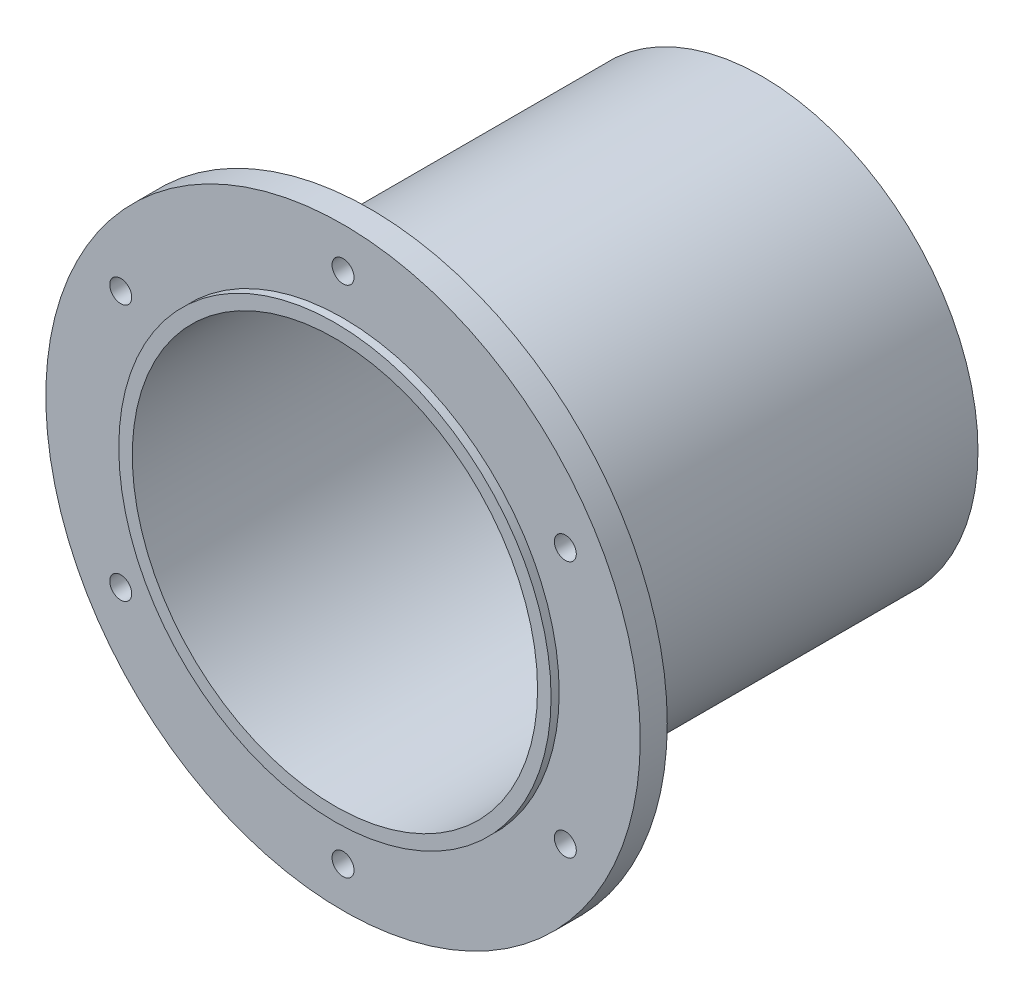
ISO-10303-21;
HEADER;
FILE_DESCRIPTION(('STEP AP214'),'2;1');
FILE_NAME('part.step','',(''),(''),'','','');
FILE_SCHEMA(('AUTOMOTIVE_DESIGN { 1 0 10303 214 1 1 1 1 }'));
ENDSEC;
DATA;
#1=APPLICATION_CONTEXT('core data for automotive mechanical design processes');
#2=APPLICATION_PROTOCOL_DEFINITION('international standard','automotive_design',2000,#1);
#3=PRODUCT_CONTEXT('',#1,'mechanical');
#4=PRODUCT('Part','Part','',(#3));
#5=PRODUCT_RELATED_PRODUCT_CATEGORY('part','',(#4));
#6=PRODUCT_DEFINITION_FORMATION('','',#4);
#7=PRODUCT_DEFINITION_CONTEXT('part definition',#1,'design');
#8=PRODUCT_DEFINITION('design','',#6,#7);
#9=PRODUCT_DEFINITION_SHAPE('','',#8);
#10=(LENGTH_UNIT() NAMED_UNIT(*) SI_UNIT(.MILLI.,.METRE.));
#11=(NAMED_UNIT(*) PLANE_ANGLE_UNIT() SI_UNIT($,.RADIAN.));
#12=(NAMED_UNIT(*) SI_UNIT($,.STERADIAN.) SOLID_ANGLE_UNIT());
#13=UNCERTAINTY_MEASURE_WITH_UNIT(LENGTH_MEASURE(1.E-05),#10,'distance_accuracy_value','');
#14=(GEOMETRIC_REPRESENTATION_CONTEXT(3) GLOBAL_UNCERTAINTY_ASSIGNED_CONTEXT((#13)) GLOBAL_UNIT_ASSIGNED_CONTEXT((#10,
#11,#12)) REPRESENTATION_CONTEXT('',''));
#15=CARTESIAN_POINT('',(0.,0.,0.));
#16=DIRECTION('',(0.,0.,1.));
#17=DIRECTION('',(1.,0.,0.));
#18=AXIS2_PLACEMENT_3D('',#15,#16,#17);
#19=CARTESIAN_POINT('',(0.,0.,8.255));
#20=DIRECTION('',(0.,0.,1.));
#21=DIRECTION('',(1.,0.,0.));
#22=AXIS2_PLACEMENT_3D('',#19,#20,#21);
#23=PLANE('',#22);
#24=CARTESIAN_POINT('',(0.,0.,8.255));
#25=DIRECTION('',(0.,0.,1.));
#26=DIRECTION('',(1.,0.,0.));
#27=AXIS2_PLACEMENT_3D('',#24,#25,#26);
#28=CIRCLE('',#27,50.8);
#29=CARTESIAN_POINT('',(50.8,0.,8.255));
#30=VERTEX_POINT('',#29);
#31=EDGE_CURVE('E11',#30,#30,#28,.T.);
#32=ORIENTED_EDGE('',*,*,#31,.T.);
#33=EDGE_LOOP('',(#32));
#34=FACE_BOUND('',#33,.T.);
#35=CARTESIAN_POINT('',(0.,0.,8.255));
#36=DIRECTION('',(0.,0.,1.));
#37=DIRECTION('',(1.,0.,0.));
#38=AXIS2_PLACEMENT_3D('',#35,#36,#37);
#39=CIRCLE('',#38,47.625);
#40=CARTESIAN_POINT('',(47.625,0.,8.255));
#41=VERTEX_POINT('',#40);
#42=EDGE_CURVE('E365',#41,#41,#39,.T.);
#43=ORIENTED_EDGE('',*,*,#42,.F.);
#44=EDGE_LOOP('',(#43));
#45=FACE_BOUND('',#44,.T.);
#46=ADVANCED_FACE('F358',(#34,#45),#23,.T.);
#47=CARTESIAN_POINT('',(0.,0.,8.255));
#48=DIRECTION('',(0.,0.,-1.));
#49=DIRECTION('',(-1.,0.,0.));
#50=AXIS2_PLACEMENT_3D('',#47,#48,#49);
#51=CYLINDRICAL_SURFACE('',#50,50.8);
#52=ORIENTED_EDGE('',*,*,#31,.F.);
#53=EDGE_LOOP('',(#52));
#54=FACE_BOUND('',#53,.T.);
#55=CARTESIAN_POINT('',(0.,0.,-92.075));
#56=DIRECTION('',(0.,0.,1.));
#57=DIRECTION('',(1.,0.,0.));
#58=AXIS2_PLACEMENT_3D('',#55,#56,#57);
#59=CIRCLE('',#58,50.8);
#60=CARTESIAN_POINT('',(50.8,0.,-92.075));
#61=VERTEX_POINT('',#60);
#62=EDGE_CURVE('E369',#61,#61,#59,.T.);
#63=ORIENTED_EDGE('',*,*,#62,.T.);
#64=EDGE_LOOP('',(#63));
#65=FACE_BOUND('',#64,.T.);
#66=ADVANCED_FACE('F360',(#54,#65),#51,.T.);
#67=CARTESIAN_POINT('',(0.,0.,8.255));
#68=DIRECTION('',(0.,0.,-1.));
#69=DIRECTION('',(-1.,0.,0.));
#70=AXIS2_PLACEMENT_3D('',#67,#68,#69);
#71=CYLINDRICAL_SURFACE('',#70,47.625);
#72=ORIENTED_EDGE('',*,*,#42,.T.);
#73=EDGE_LOOP('',(#72));
#74=FACE_BOUND('',#73,.T.);
#75=CARTESIAN_POINT('',(0.,0.,-92.075));
#76=DIRECTION('',(0.,0.,1.));
#77=DIRECTION('',(1.,0.,0.));
#78=AXIS2_PLACEMENT_3D('',#75,#76,#77);
#79=CIRCLE('',#78,47.625);
#80=CARTESIAN_POINT('',(47.625,0.,-92.075));
#81=VERTEX_POINT('',#80);
#82=EDGE_CURVE('E373',#81,#81,#79,.T.);
#83=ORIENTED_EDGE('',*,*,#82,.F.);
#84=EDGE_LOOP('',(#83));
#85=FACE_BOUND('',#84,.T.);
#86=ADVANCED_FACE('F382',(#74,#85),#71,.F.);
#87=CARTESIAN_POINT('',(0.,0.,-92.075));
#88=DIRECTION('',(0.,0.,1.));
#89=DIRECTION('',(1.,0.,0.));
#90=AXIS2_PLACEMENT_3D('',#87,#88,#89);
#91=PLANE('',#90);
#92=ORIENTED_EDGE('',*,*,#82,.T.);
#93=EDGE_LOOP('',(#92));
#94=FACE_BOUND('',#93,.T.);
#95=ORIENTED_EDGE('',*,*,#62,.F.);
#96=EDGE_LOOP('',(#95));
#97=FACE_BOUND('',#96,.T.);
#98=ADVANCED_FACE('F379',(#94,#97),#91,.F.);
#99=CLOSED_SHELL('',(#46,#66,#86,#98));
#100=MANIFOLD_SOLID_BREP('B2',#99);
#101=CARTESIAN_POINT('',(0.,0.,6.35));
#102=DIRECTION('',(0.,0.,1.));
#103=DIRECTION('',(1.,0.,0.));
#104=AXIS2_PLACEMENT_3D('',#101,#102,#103);
#105=PLANE('',#104);
#106=CARTESIAN_POINT('',(52.2429824832962,-30.1625,6.35));
#107=DIRECTION('',(0.,0.,1.));
#108=DIRECTION('',(1.,0.,0.));
#109=AXIS2_PLACEMENT_3D('',#106,#107,#108);
#110=CIRCLE('',#109,2.57937);
#111=CARTESIAN_POINT('',(54.8223524832962,-30.1625,6.35));
#112=VERTEX_POINT('',#111);
#113=EDGE_CURVE('E455',#112,#112,#110,.T.);
#114=ORIENTED_EDGE('',*,*,#113,.F.);
#115=EDGE_LOOP('',(#114));
#116=FACE_BOUND('',#115,.T.);
#117=CARTESIAN_POINT('',(-52.2429824832963,-30.1625,6.35));
#118=DIRECTION('',(0.,0.,1.));
#119=DIRECTION('',(1.,0.,0.));
#120=AXIS2_PLACEMENT_3D('',#117,#118,#119);
#121=CIRCLE('',#120,2.57937);
#122=CARTESIAN_POINT('',(-49.6636124832963,-30.1625,6.35));
#123=VERTEX_POINT('',#122);
#124=EDGE_CURVE('E443',#123,#123,#121,.T.);
#125=ORIENTED_EDGE('',*,*,#124,.F.);
#126=EDGE_LOOP('',(#125));
#127=FACE_BOUND('',#126,.T.);
#128=CARTESIAN_POINT('',(0.,60.325,6.35));
#129=DIRECTION('',(0.,0.,1.));
#130=DIRECTION('',(1.,0.,0.));
#131=AXIS2_PLACEMENT_3D('',#128,#129,#130);
#132=CIRCLE('',#131,2.57937);
#133=CARTESIAN_POINT('',(2.57937,60.325,6.35));
#134=VERTEX_POINT('',#133);
#135=EDGE_CURVE('E431',#134,#134,#132,.T.);
#136=ORIENTED_EDGE('',*,*,#135,.F.);
#137=EDGE_LOOP('',(#136));
#138=FACE_BOUND('',#137,.T.);
#139=CARTESIAN_POINT('',(0.,0.,6.35));
#140=DIRECTION('',(0.,0.,1.));
#141=DIRECTION('',(1.,0.,0.));
#142=AXIS2_PLACEMENT_3D('',#139,#140,#141);
#143=CIRCLE('',#142,69.85);
#144=CARTESIAN_POINT('',(69.85,0.,6.35));
#145=VERTEX_POINT('',#144);
#146=EDGE_CURVE('E357',#145,#145,#143,.T.);
#147=ORIENTED_EDGE('',*,*,#146,.T.);
#148=EDGE_LOOP('',(#147));
#149=FACE_BOUND('',#148,.T.);
#150=CARTESIAN_POINT('',(0.,0.,6.35));
#151=DIRECTION('',(0.,0.,1.));
#152=DIRECTION('',(1.,0.,0.));
#153=AXIS2_PLACEMENT_3D('',#150,#151,#152);
#154=CIRCLE('',#153,50.8);
#155=CARTESIAN_POINT('',(50.8,0.,6.35));
#156=VERTEX_POINT('',#155);
#157=EDGE_CURVE('E422',#156,#156,#154,.T.);
#158=ORIENTED_EDGE('',*,*,#157,.F.);
#159=EDGE_LOOP('',(#158));
#160=FACE_BOUND('',#159,.T.);
#161=CARTESIAN_POINT('',(-52.2429824832963,30.1625,6.35));
#162=DIRECTION('',(0.,0.,1.));
#163=DIRECTION('',(1.,0.,0.));
#164=AXIS2_PLACEMENT_3D('',#161,#162,#163);
#165=CIRCLE('',#164,2.57937);
#166=CARTESIAN_POINT('',(-49.6636124832963,30.1625,6.35));
#167=VERTEX_POINT('',#166);
#168=EDGE_CURVE('E437',#167,#167,#165,.T.);
#169=ORIENTED_EDGE('',*,*,#168,.F.);
#170=EDGE_LOOP('',(#169));
#171=FACE_BOUND('',#170,.T.);
#172=CARTESIAN_POINT('',(0.,-60.325,6.35));
#173=DIRECTION('',(0.,0.,1.));
#174=DIRECTION('',(1.,0.,0.));
#175=AXIS2_PLACEMENT_3D('',#172,#173,#174);
#176=CIRCLE('',#175,2.57937);
#177=CARTESIAN_POINT('',(2.57937,-60.325,6.35));
#178=VERTEX_POINT('',#177);
#179=EDGE_CURVE('E449',#178,#178,#176,.T.);
#180=ORIENTED_EDGE('',*,*,#179,.F.);
#181=EDGE_LOOP('',(#180));
#182=FACE_BOUND('',#181,.T.);
#183=CARTESIAN_POINT('',(52.2429824832963,30.1625,6.35));
#184=DIRECTION('',(0.,0.,1.));
#185=DIRECTION('',(1.,0.,0.));
#186=AXIS2_PLACEMENT_3D('',#183,#184,#185);
#187=CIRCLE('',#186,2.57937);
#188=CARTESIAN_POINT('',(54.8223524832963,30.1625,6.35));
#189=VERTEX_POINT('',#188);
#190=EDGE_CURVE('E461',#189,#189,#187,.T.);
#191=ORIENTED_EDGE('',*,*,#190,.F.);
#192=EDGE_LOOP('',(#191));
#193=FACE_BOUND('',#192,.T.);
#194=ADVANCED_FACE('F411',(#116,#127,#138,#149,#160,#171,#182,#193),#105,.T.);
#195=CARTESIAN_POINT('',(0.,0.,0.));
#196=DIRECTION('',(0.,0.,1.));
#197=DIRECTION('',(1.,0.,0.));
#198=AXIS2_PLACEMENT_3D('',#195,#196,#197);
#199=PLANE('',#198);
#200=CARTESIAN_POINT('',(52.2429824832962,-30.1625,0.));
#201=DIRECTION('',(0.,0.,1.));
#202=DIRECTION('',(1.,0.,0.));
#203=AXIS2_PLACEMENT_3D('',#200,#201,#202);
#204=CIRCLE('',#203,2.57937);
#205=CARTESIAN_POINT('',(54.8223524832962,-30.1625,0.));
#206=VERTEX_POINT('',#205);
#207=EDGE_CURVE('E458',#206,#206,#204,.T.);
#208=ORIENTED_EDGE('',*,*,#207,.T.);
#209=EDGE_LOOP('',(#208));
#210=FACE_BOUND('',#209,.T.);
#211=CARTESIAN_POINT('',(-52.2429824832963,-30.1625,0.));
#212=DIRECTION('',(0.,0.,1.));
#213=DIRECTION('',(1.,0.,0.));
#214=AXIS2_PLACEMENT_3D('',#211,#212,#213);
#215=CIRCLE('',#214,2.57937);
#216=CARTESIAN_POINT('',(-49.6636124832963,-30.1625,0.));
#217=VERTEX_POINT('',#216);
#218=EDGE_CURVE('E446',#217,#217,#215,.T.);
#219=ORIENTED_EDGE('',*,*,#218,.T.);
#220=EDGE_LOOP('',(#219));
#221=FACE_BOUND('',#220,.T.);
#222=CARTESIAN_POINT('',(0.,60.325,0.));
#223=DIRECTION('',(0.,0.,1.));
#224=DIRECTION('',(1.,0.,0.));
#225=AXIS2_PLACEMENT_3D('',#222,#223,#224);
#226=CIRCLE('',#225,2.57937);
#227=CARTESIAN_POINT('',(2.57937,60.325,0.));
#228=VERTEX_POINT('',#227);
#229=EDGE_CURVE('E434',#228,#228,#226,.T.);
#230=ORIENTED_EDGE('',*,*,#229,.T.);
#231=EDGE_LOOP('',(#230));
#232=FACE_BOUND('',#231,.T.);
#233=CARTESIAN_POINT('',(0.,0.,0.));
#234=DIRECTION('',(0.,0.,1.));
#235=DIRECTION('',(1.,0.,0.));
#236=AXIS2_PLACEMENT_3D('',#233,#234,#235);
#237=CIRCLE('',#236,69.85);
#238=CARTESIAN_POINT('',(69.85,0.,0.));
#239=VERTEX_POINT('',#238);
#240=EDGE_CURVE('E418',#239,#239,#237,.T.);
#241=ORIENTED_EDGE('',*,*,#240,.F.);
#242=EDGE_LOOP('',(#241));
#243=FACE_BOUND('',#242,.T.);
#244=CARTESIAN_POINT('',(0.,0.,0.));
#245=DIRECTION('',(0.,0.,1.));
#246=DIRECTION('',(1.,0.,0.));
#247=AXIS2_PLACEMENT_3D('',#244,#245,#246);
#248=CIRCLE('',#247,50.8);
#249=CARTESIAN_POINT('',(50.8,0.,0.));
#250=VERTEX_POINT('',#249);
#251=EDGE_CURVE('E426',#250,#250,#248,.T.);
#252=ORIENTED_EDGE('',*,*,#251,.T.);
#253=EDGE_LOOP('',(#252));
#254=FACE_BOUND('',#253,.T.);
#255=CARTESIAN_POINT('',(-52.2429824832963,30.1625,0.));
#256=DIRECTION('',(0.,0.,1.));
#257=DIRECTION('',(1.,0.,0.));
#258=AXIS2_PLACEMENT_3D('',#255,#256,#257);
#259=CIRCLE('',#258,2.57937);
#260=CARTESIAN_POINT('',(-49.6636124832963,30.1625,0.));
#261=VERTEX_POINT('',#260);
#262=EDGE_CURVE('E440',#261,#261,#259,.T.);
#263=ORIENTED_EDGE('',*,*,#262,.T.);
#264=EDGE_LOOP('',(#263));
#265=FACE_BOUND('',#264,.T.);
#266=CARTESIAN_POINT('',(0.,-60.325,0.));
#267=DIRECTION('',(0.,0.,1.));
#268=DIRECTION('',(1.,0.,0.));
#269=AXIS2_PLACEMENT_3D('',#266,#267,#268);
#270=CIRCLE('',#269,2.57937);
#271=CARTESIAN_POINT('',(2.57937,-60.325,0.));
#272=VERTEX_POINT('',#271);
#273=EDGE_CURVE('E452',#272,#272,#270,.T.);
#274=ORIENTED_EDGE('',*,*,#273,.T.);
#275=EDGE_LOOP('',(#274));
#276=FACE_BOUND('',#275,.T.);
#277=CARTESIAN_POINT('',(52.2429824832963,30.1625,0.));
#278=DIRECTION('',(0.,0.,1.));
#279=DIRECTION('',(1.,0.,0.));
#280=AXIS2_PLACEMENT_3D('',#277,#278,#279);
#281=CIRCLE('',#280,2.57937);
#282=CARTESIAN_POINT('',(54.8223524832963,30.1625,0.));
#283=VERTEX_POINT('',#282);
#284=EDGE_CURVE('E464',#283,#283,#281,.T.);
#285=ORIENTED_EDGE('',*,*,#284,.T.);
#286=EDGE_LOOP('',(#285));
#287=FACE_BOUND('',#286,.T.);
#288=ADVANCED_FACE('F468',(#210,#221,#232,#243,#254,#265,#276,#287),#199,.F.);
#289=CARTESIAN_POINT('',(0.,0.,6.35));
#290=DIRECTION('',(0.,0.,-1.));
#291=DIRECTION('',(-1.,0.,0.));
#292=AXIS2_PLACEMENT_3D('',#289,#290,#291);
#293=CYLINDRICAL_SURFACE('',#292,69.85);
#294=ORIENTED_EDGE('',*,*,#146,.F.);
#295=EDGE_LOOP('',(#294));
#296=FACE_BOUND('',#295,.T.);
#297=ORIENTED_EDGE('',*,*,#240,.T.);
#298=EDGE_LOOP('',(#297));
#299=FACE_BOUND('',#298,.T.);
#300=ADVANCED_FACE('F413',(#296,#299),#293,.T.);
#301=CARTESIAN_POINT('',(0.,0.,6.35));
#302=DIRECTION('',(0.,0.,-1.));
#303=DIRECTION('',(-1.,0.,0.));
#304=AXIS2_PLACEMENT_3D('',#301,#302,#303);
#305=CYLINDRICAL_SURFACE('',#304,50.8);
#306=ORIENTED_EDGE('',*,*,#157,.T.);
#307=EDGE_LOOP('',(#306));
#308=FACE_BOUND('',#307,.T.);
#309=ORIENTED_EDGE('',*,*,#251,.F.);
#310=EDGE_LOOP('',(#309));
#311=FACE_BOUND('',#310,.T.);
#312=ADVANCED_FACE('F491',(#308,#311),#305,.F.);
#313=CARTESIAN_POINT('',(0.,60.325,6.35));
#314=DIRECTION('',(0.,0.,-1.));
#315=DIRECTION('',(-1.,0.,0.));
#316=AXIS2_PLACEMENT_3D('',#313,#314,#315);
#317=CYLINDRICAL_SURFACE('',#316,2.57937);
#318=ORIENTED_EDGE('',*,*,#135,.T.);
#319=EDGE_LOOP('',(#318));
#320=FACE_BOUND('',#319,.T.);
#321=ORIENTED_EDGE('',*,*,#229,.F.);
#322=EDGE_LOOP('',(#321));
#323=FACE_BOUND('',#322,.T.);
#324=ADVANCED_FACE('F494',(#320,#323),#317,.F.);
#325=CARTESIAN_POINT('',(-52.2429824832963,30.1625,6.35));
#326=DIRECTION('',(0.,0.,-1.));
#327=DIRECTION('',(-1.,0.,0.));
#328=AXIS2_PLACEMENT_3D('',#325,#326,#327);
#329=CYLINDRICAL_SURFACE('',#328,2.57937);
#330=ORIENTED_EDGE('',*,*,#168,.T.);
#331=EDGE_LOOP('',(#330));
#332=FACE_BOUND('',#331,.T.);
#333=ORIENTED_EDGE('',*,*,#262,.F.);
#334=EDGE_LOOP('',(#333));
#335=FACE_BOUND('',#334,.T.);
#336=ADVANCED_FACE('F498',(#332,#335),#329,.F.);
#337=CARTESIAN_POINT('',(-52.2429824832963,-30.1625,6.35));
#338=DIRECTION('',(0.,0.,-1.));
#339=DIRECTION('',(-1.,0.,0.));
#340=AXIS2_PLACEMENT_3D('',#337,#338,#339);
#341=CYLINDRICAL_SURFACE('',#340,2.57937);
#342=ORIENTED_EDGE('',*,*,#124,.T.);
#343=EDGE_LOOP('',(#342));
#344=FACE_BOUND('',#343,.T.);
#345=ORIENTED_EDGE('',*,*,#218,.F.);
#346=EDGE_LOOP('',(#345));
#347=FACE_BOUND('',#346,.T.);
#348=ADVANCED_FACE('F502',(#344,#347),#341,.F.);
#349=CARTESIAN_POINT('',(0.,-60.325,6.35));
#350=DIRECTION('',(0.,0.,-1.));
#351=DIRECTION('',(-1.,0.,0.));
#352=AXIS2_PLACEMENT_3D('',#349,#350,#351);
#353=CYLINDRICAL_SURFACE('',#352,2.57937);
#354=ORIENTED_EDGE('',*,*,#179,.T.);
#355=EDGE_LOOP('',(#354));
#356=FACE_BOUND('',#355,.T.);
#357=ORIENTED_EDGE('',*,*,#273,.F.);
#358=EDGE_LOOP('',(#357));
#359=FACE_BOUND('',#358,.T.);
#360=ADVANCED_FACE('F478',(#356,#359),#353,.F.);
#361=CARTESIAN_POINT('',(52.2429824832962,-30.1625,6.35));
#362=DIRECTION('',(0.,0.,-1.));
#363=DIRECTION('',(-1.,0.,0.));
#364=AXIS2_PLACEMENT_3D('',#361,#362,#363);
#365=CYLINDRICAL_SURFACE('',#364,2.57937);
#366=ORIENTED_EDGE('',*,*,#113,.T.);
#367=EDGE_LOOP('',(#366));
#368=FACE_BOUND('',#367,.T.);
#369=ORIENTED_EDGE('',*,*,#207,.F.);
#370=EDGE_LOOP('',(#369));
#371=FACE_BOUND('',#370,.T.);
#372=ADVANCED_FACE('F472',(#368,#371),#365,.F.);
#373=CARTESIAN_POINT('',(52.2429824832963,30.1625,6.35));
#374=DIRECTION('',(0.,0.,-1.));
#375=DIRECTION('',(-1.,0.,0.));
#376=AXIS2_PLACEMENT_3D('',#373,#374,#375);
#377=CYLINDRICAL_SURFACE('',#376,2.57937);
#378=ORIENTED_EDGE('',*,*,#190,.T.);
#379=EDGE_LOOP('',(#378));
#380=FACE_BOUND('',#379,.T.);
#381=ORIENTED_EDGE('',*,*,#284,.F.);
#382=EDGE_LOOP('',(#381));
#383=FACE_BOUND('',#382,.T.);
#384=ADVANCED_FACE('F470',(#380,#383),#377,.F.);
#385=CLOSED_SHELL('',(#194,#288,#300,#312,#324,#336,#348,#360,#372,#384));
#386=MANIFOLD_SOLID_BREP('B6',#385);
#387=ADVANCED_BREP_SHAPE_REPRESENTATION('',(#18,#100,#386),#14);
#388=SHAPE_DEFINITION_REPRESENTATION(#9,#387);
ENDSEC;
END-ISO-10303-21;
